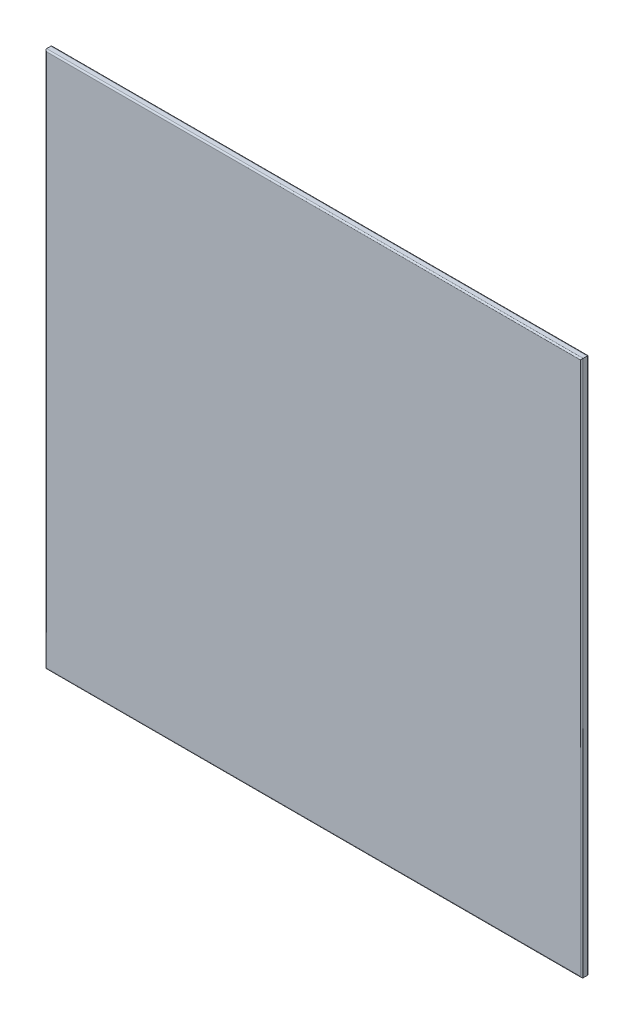
ISO-10303-21;
HEADER;
FILE_DESCRIPTION(('STEP AP214'),'2;1');
FILE_NAME('part.step','',(''),(''),'','','');
FILE_SCHEMA(('AUTOMOTIVE_DESIGN { 1 0 10303 214 1 1 1 1 }'));
ENDSEC;
DATA;
#1=APPLICATION_CONTEXT('core data for automotive mechanical design processes');
#2=APPLICATION_PROTOCOL_DEFINITION('international standard','automotive_design',2000,#1);
#3=PRODUCT_CONTEXT('',#1,'mechanical');
#4=PRODUCT('Part','Part','',(#3));
#5=PRODUCT_RELATED_PRODUCT_CATEGORY('part','',(#4));
#6=PRODUCT_DEFINITION_FORMATION('','',#4);
#7=PRODUCT_DEFINITION_CONTEXT('part definition',#1,'design');
#8=PRODUCT_DEFINITION('design','',#6,#7);
#9=PRODUCT_DEFINITION_SHAPE('','',#8);
#10=(LENGTH_UNIT() NAMED_UNIT(*) SI_UNIT(.MILLI.,.METRE.));
#11=(NAMED_UNIT(*) PLANE_ANGLE_UNIT() SI_UNIT($,.RADIAN.));
#12=(NAMED_UNIT(*) SI_UNIT($,.STERADIAN.) SOLID_ANGLE_UNIT());
#13=UNCERTAINTY_MEASURE_WITH_UNIT(LENGTH_MEASURE(1.E-05),#10,'distance_accuracy_value','');
#14=(GEOMETRIC_REPRESENTATION_CONTEXT(3) GLOBAL_UNCERTAINTY_ASSIGNED_CONTEXT((#13)) GLOBAL_UNIT_ASSIGNED_CONTEXT((#10,
#11,#12)) REPRESENTATION_CONTEXT('',''));
#15=CARTESIAN_POINT('',(0.,0.,0.));
#16=DIRECTION('',(0.,0.,1.));
#17=DIRECTION('',(1.,0.,0.));
#18=AXIS2_PLACEMENT_3D('',#15,#16,#17);
#19=CARTESIAN_POINT('',(4.99999999999812,4.99999999999745,15.));
#20=DIRECTION('',(1.,0.,0.));
#21=DIRECTION('',(0.,0.,-1.));
#22=AXIS2_PLACEMENT_3D('',#19,#20,#21);
#23=PLANE('',#22);
#24=DIRECTION('',(0.,0.,-1.));
#25=VECTOR('',#24,1.);
#26=CARTESIAN_POINT('',(4.99999999999812,1144.99999999999,15.));
#27=LINE('',#26,#25);
#28=CARTESIAN_POINT('',(4.99999999999812,1144.99999999999,12.));
#29=VERTEX_POINT('',#28);
#30=CARTESIAN_POINT('',(4.99999999999812,1144.99999999999,3.));
#31=VERTEX_POINT('',#30);
#32=EDGE_CURVE('E144',#29,#31,#27,.T.);
#33=ORIENTED_EDGE('',*,*,#32,.T.);
#34=DIRECTION('',(0.,-1.,0.));
#35=VECTOR('',#34,1.);
#36=CARTESIAN_POINT('',(4.99999999999812,4.99999999999745,3.));
#37=LINE('',#36,#35);
#38=CARTESIAN_POINT('',(4.99999999999812,4.99999999999745,3.));
#39=VERTEX_POINT('',#38);
#40=EDGE_CURVE('E153',#31,#39,#37,.T.);
#41=ORIENTED_EDGE('',*,*,#40,.T.);
#42=DIRECTION('',(0.,0.,-1.));
#43=VECTOR('',#42,1.);
#44=CARTESIAN_POINT('',(4.99999999999812,4.99999999999745,15.));
#45=LINE('',#44,#43);
#46=CARTESIAN_POINT('',(4.99999999999812,4.99999999999745,12.));
#47=VERTEX_POINT('',#46);
#48=EDGE_CURVE('E122',#47,#39,#45,.T.);
#49=ORIENTED_EDGE('',*,*,#48,.F.);
#50=DIRECTION('',(0.,-1.,0.));
#51=VECTOR('',#50,1.);
#52=CARTESIAN_POINT('',(4.99999999999812,4.99999999999745,12.));
#53=LINE('',#52,#51);
#54=EDGE_CURVE('E155',#47,#29,#53,.F.);
#55=ORIENTED_EDGE('',*,*,#54,.T.);
#56=EDGE_LOOP('',(#33,#41,#49,#55));
#57=FACE_BOUND('',#56,.T.);
#58=ADVANCED_FACE('F35',(#57),#23,.F.);
#59=CARTESIAN_POINT('',(4.99999999999812,4.99999999999745,15.));
#60=DIRECTION('',(0.,1.,0.));
#61=DIRECTION('',(0.,0.,1.));
#62=AXIS2_PLACEMENT_3D('',#59,#60,#61);
#63=PLANE('',#62);
#64=ORIENTED_EDGE('',*,*,#48,.T.);
#65=DIRECTION('',(1.,0.,0.));
#66=VECTOR('',#65,1.);
#67=CARTESIAN_POINT('',(1145.,4.99999999999745,3.));
#68=LINE('',#67,#66);
#69=CARTESIAN_POINT('',(1145.,4.99999999999745,3.));
#70=VERTEX_POINT('',#69);
#71=EDGE_CURVE('E121',#39,#70,#68,.T.);
#72=ORIENTED_EDGE('',*,*,#71,.T.);
#73=DIRECTION('',(0.,0.,-1.));
#74=VECTOR('',#73,1.);
#75=CARTESIAN_POINT('',(1145.,4.99999999999745,15.));
#76=LINE('',#75,#74);
#77=CARTESIAN_POINT('',(1145.,4.99999999999745,12.));
#78=VERTEX_POINT('',#77);
#79=EDGE_CURVE('E104',#78,#70,#76,.T.);
#80=ORIENTED_EDGE('',*,*,#79,.F.);
#81=DIRECTION('',(1.,0.,0.));
#82=VECTOR('',#81,1.);
#83=CARTESIAN_POINT('',(4.99999999999812,4.99999999999745,12.));
#84=LINE('',#83,#82);
#85=EDGE_CURVE('E118',#78,#47,#84,.F.);
#86=ORIENTED_EDGE('',*,*,#85,.T.);
#87=EDGE_LOOP('',(#64,#72,#80,#86));
#88=FACE_BOUND('',#87,.T.);
#89=ADVANCED_FACE('F117',(#88),#63,.F.);
#90=CARTESIAN_POINT('',(1145.,4.99999999999745,15.));
#91=DIRECTION('',(-1.,0.,0.));
#92=DIRECTION('',(0.,0.,1.));
#93=AXIS2_PLACEMENT_3D('',#90,#91,#92);
#94=PLANE('',#93);
#95=ORIENTED_EDGE('',*,*,#79,.T.);
#96=DIRECTION('',(0.,1.,0.));
#97=VECTOR('',#96,1.);
#98=CARTESIAN_POINT('',(1145.,1144.99999999999,3.));
#99=LINE('',#98,#97);
#100=CARTESIAN_POINT('',(1145.,1144.99999999999,3.));
#101=VERTEX_POINT('',#100);
#102=EDGE_CURVE('E110',#70,#101,#99,.T.);
#103=ORIENTED_EDGE('',*,*,#102,.T.);
#104=DIRECTION('',(0.,0.,-1.));
#105=VECTOR('',#104,1.);
#106=CARTESIAN_POINT('',(1145.,1144.99999999999,15.));
#107=LINE('',#106,#105);
#108=CARTESIAN_POINT('',(1145.,1144.99999999999,12.));
#109=VERTEX_POINT('',#108);
#110=EDGE_CURVE('E106',#109,#101,#107,.T.);
#111=ORIENTED_EDGE('',*,*,#110,.F.);
#112=DIRECTION('',(0.,1.,0.));
#113=VECTOR('',#112,1.);
#114=CARTESIAN_POINT('',(1145.,4.99999999999745,12.));
#115=LINE('',#114,#113);
#116=EDGE_CURVE('E101',#109,#78,#115,.F.);
#117=ORIENTED_EDGE('',*,*,#116,.T.);
#118=EDGE_LOOP('',(#95,#103,#111,#117));
#119=FACE_BOUND('',#118,.T.);
#120=ADVANCED_FACE('F103',(#119),#94,.F.);
#121=CARTESIAN_POINT('',(4.99999999999812,1144.99999999999,15.));
#122=DIRECTION('',(0.,-1.,0.));
#123=DIRECTION('',(0.,0.,-1.));
#124=AXIS2_PLACEMENT_3D('',#121,#122,#123);
#125=PLANE('',#124);
#126=ORIENTED_EDGE('',*,*,#110,.T.);
#127=DIRECTION('',(-1.,0.,0.));
#128=VECTOR('',#127,1.);
#129=CARTESIAN_POINT('',(4.99999999999812,1144.99999999999,3.));
#130=LINE('',#129,#128);
#131=EDGE_CURVE('E157',#101,#31,#130,.T.);
#132=ORIENTED_EDGE('',*,*,#131,.T.);
#133=ORIENTED_EDGE('',*,*,#32,.F.);
#134=DIRECTION('',(-1.,0.,0.));
#135=VECTOR('',#134,1.);
#136=CARTESIAN_POINT('',(4.99999999999812,1144.99999999999,12.));
#137=LINE('',#136,#135);
#138=EDGE_CURVE('E159',#29,#109,#137,.F.);
#139=ORIENTED_EDGE('',*,*,#138,.T.);
#140=EDGE_LOOP('',(#126,#132,#133,#139));
#141=FACE_BOUND('',#140,.T.);
#142=ADVANCED_FACE('F197',(#141),#125,.F.);
#143=CARTESIAN_POINT('',(0.,0.,15.));
#144=DIRECTION('',(0.,0.,-1.));
#145=DIRECTION('',(-1.,0.,0.));
#146=AXIS2_PLACEMENT_3D('',#143,#144,#145);
#147=PLANE('',#146);
#148=DIRECTION('',(0.,1.,0.));
#149=VECTOR('',#148,1.);
#150=CARTESIAN_POINT('',(1142.,0.,15.));
#151=LINE('',#150,#149);
#152=CARTESIAN_POINT('',(1142.,7.99999999999745,15.));
#153=VERTEX_POINT('',#152);
#154=CARTESIAN_POINT('',(1142.,1141.99999999999,15.));
#155=VERTEX_POINT('',#154);
#156=EDGE_CURVE('E44',#153,#155,#151,.T.);
#157=ORIENTED_EDGE('',*,*,#156,.T.);
#158=DIRECTION('',(-1.,0.,0.));
#159=VECTOR('',#158,1.);
#160=CARTESIAN_POINT('',(0.,1141.99999999999,15.));
#161=LINE('',#160,#159);
#162=CARTESIAN_POINT('',(7.99999999999812,1141.99999999999,15.));
#163=VERTEX_POINT('',#162);
#164=EDGE_CURVE('E11',#155,#163,#161,.T.);
#165=ORIENTED_EDGE('',*,*,#164,.T.);
#166=DIRECTION('',(0.,-1.,0.));
#167=VECTOR('',#166,1.);
#168=CARTESIAN_POINT('',(7.99999999999812,0.,15.));
#169=LINE('',#168,#167);
#170=CARTESIAN_POINT('',(7.99999999999812,7.99999999999745,15.));
#171=VERTEX_POINT('',#170);
#172=EDGE_CURVE('E151',#163,#171,#169,.T.);
#173=ORIENTED_EDGE('',*,*,#172,.T.);
#174=DIRECTION('',(1.,0.,0.));
#175=VECTOR('',#174,1.);
#176=CARTESIAN_POINT('',(0.,7.99999999999745,15.));
#177=LINE('',#176,#175);
#178=EDGE_CURVE('E55',#171,#153,#177,.T.);
#179=ORIENTED_EDGE('',*,*,#178,.T.);
#180=EDGE_LOOP('',(#157,#165,#173,#179));
#181=FACE_BOUND('',#180,.T.);
#182=ADVANCED_FACE('F203',(#181),#147,.F.);
#183=CARTESIAN_POINT('',(0.,0.,0.));
#184=DIRECTION('',(0.,0.,-1.));
#185=DIRECTION('',(-1.,0.,0.));
#186=AXIS2_PLACEMENT_3D('',#183,#184,#185);
#187=PLANE('',#186);
#188=DIRECTION('',(0.,1.,0.));
#189=VECTOR('',#188,1.);
#190=CARTESIAN_POINT('',(1142.,4.99999999999745,0.));
#191=LINE('',#190,#189);
#192=CARTESIAN_POINT('',(1142.,1141.99999999999,0.));
#193=VERTEX_POINT('',#192);
#194=CARTESIAN_POINT('',(1142.,7.99999999999745,0.));
#195=VERTEX_POINT('',#194);
#196=EDGE_CURVE('E164',#193,#195,#191,.F.);
#197=ORIENTED_EDGE('',*,*,#196,.T.);
#198=DIRECTION('',(1.,0.,0.));
#199=VECTOR('',#198,1.);
#200=CARTESIAN_POINT('',(4.99999999999812,7.99999999999745,0.));
#201=LINE('',#200,#199);
#202=CARTESIAN_POINT('',(7.99999999999812,7.99999999999745,0.));
#203=VERTEX_POINT('',#202);
#204=EDGE_CURVE('E111',#195,#203,#201,.F.);
#205=ORIENTED_EDGE('',*,*,#204,.T.);
#206=DIRECTION('',(0.,-1.,0.));
#207=VECTOR('',#206,1.);
#208=CARTESIAN_POINT('',(7.99999999999812,1144.99999999999,0.));
#209=LINE('',#208,#207);
#210=CARTESIAN_POINT('',(7.99999999999812,1141.99999999999,0.));
#211=VERTEX_POINT('',#210);
#212=EDGE_CURVE('E168',#203,#211,#209,.F.);
#213=ORIENTED_EDGE('',*,*,#212,.T.);
#214=DIRECTION('',(-1.,0.,0.));
#215=VECTOR('',#214,1.);
#216=CARTESIAN_POINT('',(1145.,1141.99999999999,0.));
#217=LINE('',#216,#215);
#218=EDGE_CURVE('E166',#211,#193,#217,.F.);
#219=ORIENTED_EDGE('',*,*,#218,.T.);
#220=EDGE_LOOP('',(#197,#205,#213,#219));
#221=FACE_BOUND('',#220,.T.);
#222=ADVANCED_FACE('F205',(#221),#187,.T.);
#223=CARTESIAN_POINT('',(4.99999999999812,1141.99999999999,3.));
#224=DIRECTION('',(1.,0.,0.));
#225=DIRECTION('',(0.,0.,-1.));
#226=AXIS2_PLACEMENT_3D('',#223,#224,#225);
#227=CYLINDRICAL_SURFACE('',#226,3.);
#228=CARTESIAN_POINT('',(1142.,1141.99999999999,3.));
#229=DIRECTION('',(0.707106781186547,-0.707106781186547,0.));
#230=DIRECTION('',(0.707106781186547,0.707106781186547,0.));
#231=AXIS2_PLACEMENT_3D('',#228,#229,#230);
#232=ELLIPSE('',#231,4.24264068711928,3.);
#233=EDGE_CURVE('E145',#193,#101,#232,.T.);
#234=ORIENTED_EDGE('',*,*,#233,.F.);
#235=ORIENTED_EDGE('',*,*,#218,.F.);
#236=CARTESIAN_POINT('',(7.99999999999812,1141.99999999999,3.));
#237=DIRECTION('',(0.707106781186547,0.707106781186547,0.));
#238=DIRECTION('',(-0.707106781186547,0.707106781186547,0.));
#239=AXIS2_PLACEMENT_3D('',#236,#237,#238);
#240=ELLIPSE('',#239,4.24264068711928,3.);
#241=EDGE_CURVE('E141',#31,#211,#240,.F.);
#242=ORIENTED_EDGE('',*,*,#241,.F.);
#243=ORIENTED_EDGE('',*,*,#131,.F.);
#244=EDGE_LOOP('',(#234,#235,#242,#243));
#245=FACE_BOUND('',#244,.T.);
#246=ADVANCED_FACE('F184',(#245),#227,.T.);
#247=CARTESIAN_POINT('',(7.99999999999812,4.99999999999745,3.));
#248=DIRECTION('',(0.,1.,0.));
#249=DIRECTION('',(0.,0.,1.));
#250=AXIS2_PLACEMENT_3D('',#247,#248,#249);
#251=CYLINDRICAL_SURFACE('',#250,3.);
#252=ORIENTED_EDGE('',*,*,#241,.T.);
#253=ORIENTED_EDGE('',*,*,#212,.F.);
#254=CARTESIAN_POINT('',(7.99999999999812,7.99999999999745,3.));
#255=DIRECTION('',(-0.707106781186547,0.707106781186547,0.));
#256=DIRECTION('',(0.707106781186547,0.707106781186547,0.));
#257=AXIS2_PLACEMENT_3D('',#254,#255,#256);
#258=ELLIPSE('',#257,4.24264068711928,3.);
#259=EDGE_CURVE('E132',#39,#203,#258,.F.);
#260=ORIENTED_EDGE('',*,*,#259,.F.);
#261=ORIENTED_EDGE('',*,*,#40,.F.);
#262=EDGE_LOOP('',(#252,#253,#260,#261));
#263=FACE_BOUND('',#262,.T.);
#264=ADVANCED_FACE('F188',(#263),#251,.T.);
#265=CARTESIAN_POINT('',(1142.,4.99999999999745,3.));
#266=DIRECTION('',(0.,-1.,0.));
#267=DIRECTION('',(0.,0.,-1.));
#268=AXIS2_PLACEMENT_3D('',#265,#266,#267);
#269=CYLINDRICAL_SURFACE('',#268,3.);
#270=ORIENTED_EDGE('',*,*,#233,.T.);
#271=ORIENTED_EDGE('',*,*,#102,.F.);
#272=CARTESIAN_POINT('',(1142.,7.99999999999745,3.));
#273=DIRECTION('',(-0.707106781186547,-0.707106781186547,0.));
#274=DIRECTION('',(0.707106781186547,-0.707106781186547,0.));
#275=AXIS2_PLACEMENT_3D('',#272,#273,#274);
#276=ELLIPSE('',#275,4.24264068711928,3.);
#277=EDGE_CURVE('E131',#195,#70,#276,.T.);
#278=ORIENTED_EDGE('',*,*,#277,.F.);
#279=ORIENTED_EDGE('',*,*,#196,.F.);
#280=EDGE_LOOP('',(#270,#271,#278,#279));
#281=FACE_BOUND('',#280,.T.);
#282=ADVANCED_FACE('F196',(#281),#269,.T.);
#283=CARTESIAN_POINT('',(4.99999999999812,7.99999999999745,3.));
#284=DIRECTION('',(-1.,0.,0.));
#285=DIRECTION('',(0.,0.,1.));
#286=AXIS2_PLACEMENT_3D('',#283,#284,#285);
#287=CYLINDRICAL_SURFACE('',#286,3.);
#288=ORIENTED_EDGE('',*,*,#259,.T.);
#289=ORIENTED_EDGE('',*,*,#204,.F.);
#290=ORIENTED_EDGE('',*,*,#277,.T.);
#291=ORIENTED_EDGE('',*,*,#71,.F.);
#292=EDGE_LOOP('',(#288,#289,#290,#291));
#293=FACE_BOUND('',#292,.T.);
#294=ADVANCED_FACE('F191',(#293),#287,.T.);
#295=CARTESIAN_POINT('',(0.,7.99999999999745,12.));
#296=DIRECTION('',(1.,0.,0.));
#297=DIRECTION('',(0.,0.,-1.));
#298=AXIS2_PLACEMENT_3D('',#295,#296,#297);
#299=CYLINDRICAL_SURFACE('',#298,3.);
#300=CARTESIAN_POINT('',(7.99999999999812,7.99999999999745,12.));
#301=DIRECTION('',(0.707106781186547,-0.707106781186547,0.));
#302=DIRECTION('',(-0.707106781186547,-0.707106781186547,0.));
#303=AXIS2_PLACEMENT_3D('',#300,#301,#302);
#304=ELLIPSE('',#303,4.24264068711928,3.);
#305=EDGE_CURVE('E127',#47,#171,#304,.F.);
#306=ORIENTED_EDGE('',*,*,#305,.F.);
#307=ORIENTED_EDGE('',*,*,#85,.F.);
#308=CARTESIAN_POINT('',(1142.,7.99999999999745,12.));
#309=DIRECTION('',(0.707106781186547,0.707106781186547,0.));
#310=DIRECTION('',(0.707106781186547,-0.707106781186547,0.));
#311=AXIS2_PLACEMENT_3D('',#308,#309,#310);
#312=ELLIPSE('',#311,4.24264068711928,3.);
#313=EDGE_CURVE('E39',#153,#78,#312,.T.);
#314=ORIENTED_EDGE('',*,*,#313,.F.);
#315=ORIENTED_EDGE('',*,*,#178,.F.);
#316=EDGE_LOOP('',(#306,#307,#314,#315));
#317=FACE_BOUND('',#316,.T.);
#318=ADVANCED_FACE('F37',(#317),#299,.T.);
#319=CARTESIAN_POINT('',(1142.,0.,12.));
#320=DIRECTION('',(0.,1.,0.));
#321=DIRECTION('',(0.,0.,1.));
#322=AXIS2_PLACEMENT_3D('',#319,#320,#321);
#323=CYLINDRICAL_SURFACE('',#322,3.);
#324=ORIENTED_EDGE('',*,*,#313,.T.);
#325=ORIENTED_EDGE('',*,*,#116,.F.);
#326=CARTESIAN_POINT('',(1142.,1141.99999999999,12.));
#327=DIRECTION('',(-0.707106781186547,0.707106781186547,0.));
#328=DIRECTION('',(0.707106781186547,0.707106781186547,0.));
#329=AXIS2_PLACEMENT_3D('',#326,#327,#328);
#330=ELLIPSE('',#329,4.24264068711928,3.);
#331=EDGE_CURVE('E134',#155,#109,#330,.T.);
#332=ORIENTED_EDGE('',*,*,#331,.F.);
#333=ORIENTED_EDGE('',*,*,#156,.F.);
#334=EDGE_LOOP('',(#324,#325,#332,#333));
#335=FACE_BOUND('',#334,.T.);
#336=ADVANCED_FACE('F130',(#335),#323,.T.);
#337=CARTESIAN_POINT('',(7.99999999999812,0.,12.));
#338=DIRECTION('',(0.,-1.,0.));
#339=DIRECTION('',(0.,0.,-1.));
#340=AXIS2_PLACEMENT_3D('',#337,#338,#339);
#341=CYLINDRICAL_SURFACE('',#340,3.);
#342=ORIENTED_EDGE('',*,*,#305,.T.);
#343=ORIENTED_EDGE('',*,*,#172,.F.);
#344=CARTESIAN_POINT('',(7.99999999999812,1141.99999999999,12.));
#345=DIRECTION('',(-0.707106781186547,-0.707106781186547,0.));
#346=DIRECTION('',(0.707106781186547,-0.707106781186547,0.));
#347=AXIS2_PLACEMENT_3D('',#344,#345,#346);
#348=ELLIPSE('',#347,4.24264068711928,3.);
#349=EDGE_CURVE('E137',#29,#163,#348,.F.);
#350=ORIENTED_EDGE('',*,*,#349,.F.);
#351=ORIENTED_EDGE('',*,*,#54,.F.);
#352=EDGE_LOOP('',(#342,#343,#350,#351));
#353=FACE_BOUND('',#352,.T.);
#354=ADVANCED_FACE('F202',(#353),#341,.T.);
#355=CARTESIAN_POINT('',(0.,1141.99999999999,12.));
#356=DIRECTION('',(-1.,0.,0.));
#357=DIRECTION('',(0.,0.,1.));
#358=AXIS2_PLACEMENT_3D('',#355,#356,#357);
#359=CYLINDRICAL_SURFACE('',#358,3.);
#360=ORIENTED_EDGE('',*,*,#331,.T.);
#361=ORIENTED_EDGE('',*,*,#138,.F.);
#362=ORIENTED_EDGE('',*,*,#349,.T.);
#363=ORIENTED_EDGE('',*,*,#164,.F.);
#364=EDGE_LOOP('',(#360,#361,#362,#363));
#365=FACE_BOUND('',#364,.T.);
#366=ADVANCED_FACE('F200',(#365),#359,.T.);
#367=CLOSED_SHELL('',(#58,#89,#120,#142,#182,#222,#246,#264,#282,#294,#318,#336,#354,#366));
#368=MANIFOLD_SOLID_BREP('B2',#367);
#369=ADVANCED_BREP_SHAPE_REPRESENTATION('',(#18,#368),#14);
#370=SHAPE_DEFINITION_REPRESENTATION(#9,#369);
ENDSEC;
END-ISO-10303-21;
